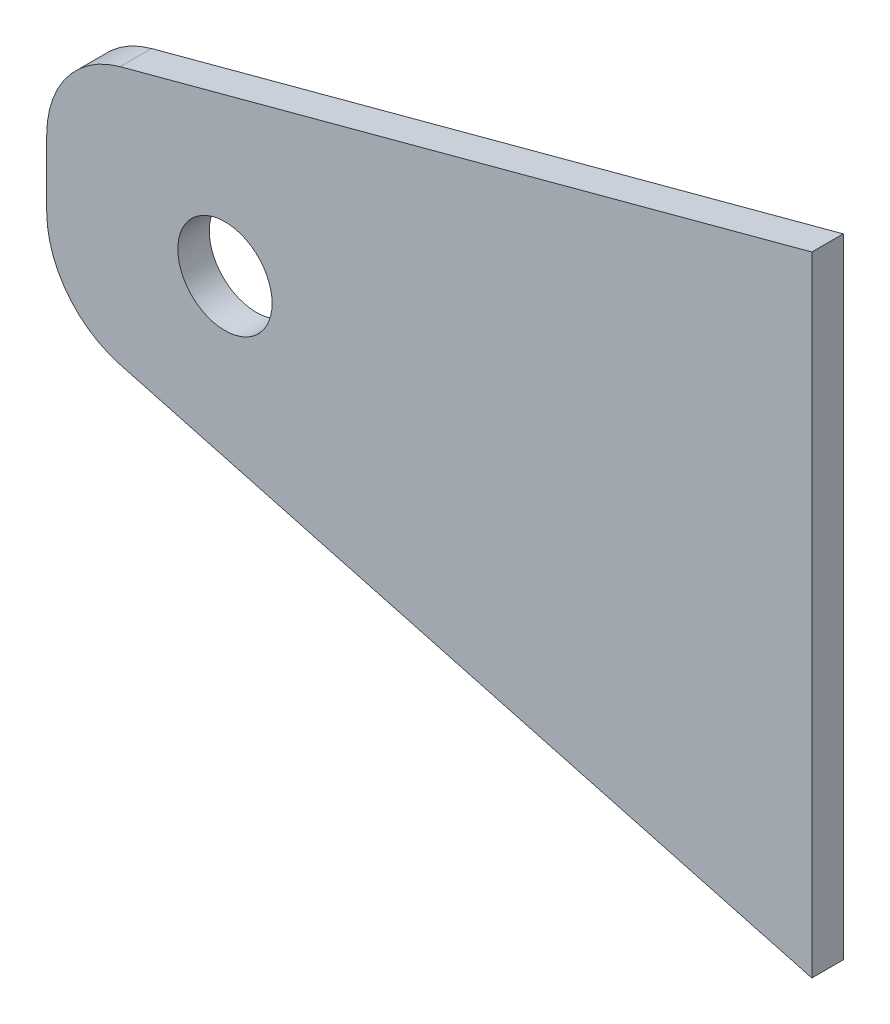
ISO-10303-21;
HEADER;
FILE_DESCRIPTION(('STEP AP214'),'2;1');
FILE_NAME('part.step','',(''),(''),'','','');
FILE_SCHEMA(('AUTOMOTIVE_DESIGN { 1 0 10303 214 1 1 1 1 }'));
ENDSEC;
DATA;
#1=APPLICATION_CONTEXT('core data for automotive mechanical design processes');
#2=APPLICATION_PROTOCOL_DEFINITION('international standard','automotive_design',2000,#1);
#3=PRODUCT_CONTEXT('',#1,'mechanical');
#4=PRODUCT('Part','Part','',(#3));
#5=PRODUCT_RELATED_PRODUCT_CATEGORY('part','',(#4));
#6=PRODUCT_DEFINITION_FORMATION('','',#4);
#7=PRODUCT_DEFINITION_CONTEXT('part definition',#1,'design');
#8=PRODUCT_DEFINITION('design','',#6,#7);
#9=PRODUCT_DEFINITION_SHAPE('','',#8);
#10=(LENGTH_UNIT() NAMED_UNIT(*) SI_UNIT(.MILLI.,.METRE.));
#11=(NAMED_UNIT(*) PLANE_ANGLE_UNIT() SI_UNIT($,.RADIAN.));
#12=(NAMED_UNIT(*) SI_UNIT($,.STERADIAN.) SOLID_ANGLE_UNIT());
#13=UNCERTAINTY_MEASURE_WITH_UNIT(LENGTH_MEASURE(1.E-05),#10,'distance_accuracy_value','');
#14=(GEOMETRIC_REPRESENTATION_CONTEXT(3) GLOBAL_UNCERTAINTY_ASSIGNED_CONTEXT((#13)) GLOBAL_UNIT_ASSIGNED_CONTEXT((#10,
#11,#12)) REPRESENTATION_CONTEXT('',''));
#15=CARTESIAN_POINT('',(0.,0.,0.));
#16=DIRECTION('',(0.,0.,1.));
#17=DIRECTION('',(1.,0.,0.));
#18=AXIS2_PLACEMENT_3D('',#15,#16,#17);
#19=CARTESIAN_POINT('',(0.,0.,3.175));
#20=DIRECTION('',(0.258819045102518,0.965925826289069,0.));
#21=DIRECTION('',(-0.965925826289069,0.258819045102518,0.));
#22=AXIS2_PLACEMENT_3D('',#19,#20,#21);
#23=PLANE('',#22);
#24=DIRECTION('',(0.965925826289069,-0.258819045102518,0.));
#25=VECTOR('',#24,1.);
#26=CARTESIAN_POINT('',(0.,0.,3.175));
#27=LINE('',#26,#25);
#28=CARTESIAN_POINT('',(-69.8622565541506,18.7195352251003,3.175));
#29=VERTEX_POINT('',#28);
#30=CARTESIAN_POINT('',(0.,0.,3.175));
#31=VERTEX_POINT('',#30);
#32=EDGE_CURVE('E91',#29,#31,#27,.T.);
#33=ORIENTED_EDGE('',*,*,#32,.F.);
#34=DIRECTION('',(0.,0.,-1.));
#35=VECTOR('',#34,1.);
#36=CARTESIAN_POINT('',(-69.8622565541506,18.7195352251003,3.175));
#37=LINE('',#36,#35);
#38=CARTESIAN_POINT('',(-69.8622565541506,18.7195352251003,0.));
#39=VERTEX_POINT('',#38);
#40=EDGE_CURVE('E114',#29,#39,#37,.T.);
#41=ORIENTED_EDGE('',*,*,#40,.T.);
#42=DIRECTION('',(0.965925826289069,-0.258819045102518,0.));
#43=VECTOR('',#42,1.);
#44=CARTESIAN_POINT('',(0.,0.,0.));
#45=LINE('',#44,#43);
#46=CARTESIAN_POINT('',(0.,0.,0.));
#47=VERTEX_POINT('',#46);
#48=EDGE_CURVE('E112',#39,#47,#45,.T.);
#49=ORIENTED_EDGE('',*,*,#48,.T.);
#50=DIRECTION('',(0.,0.,-1.));
#51=VECTOR('',#50,1.);
#52=CARTESIAN_POINT('',(0.,0.,3.175));
#53=LINE('',#52,#51);
#54=EDGE_CURVE('E106',#31,#47,#53,.T.);
#55=ORIENTED_EDGE('',*,*,#54,.F.);
#56=EDGE_LOOP('',(#33,#41,#49,#55));
#57=FACE_BOUND('',#56,.T.);
#58=ADVANCED_FACE('F37',(#57),#23,.F.);
#59=CARTESIAN_POINT('',(0.,0.,3.175));
#60=DIRECTION('',(-1.,0.,0.));
#61=DIRECTION('',(0.,0.,1.));
#62=AXIS2_PLACEMENT_3D('',#59,#60,#61);
#63=PLANE('',#62);
#64=DIRECTION('',(0.,1.,0.));
#65=VECTOR('',#64,1.);
#66=CARTESIAN_POINT('',(0.,0.,0.));
#67=LINE('',#66,#65);
#68=CARTESIAN_POINT('',(0.,63.5,0.));
#69=VERTEX_POINT('',#68);
#70=EDGE_CURVE('E141',#47,#69,#67,.T.);
#71=ORIENTED_EDGE('',*,*,#70,.T.);
#72=DIRECTION('',(0.,0.,-1.));
#73=VECTOR('',#72,1.);
#74=CARTESIAN_POINT('',(0.,63.5,3.175));
#75=LINE('',#74,#73);
#76=CARTESIAN_POINT('',(0.,63.5,3.175));
#77=VERTEX_POINT('',#76);
#78=EDGE_CURVE('E108',#77,#69,#75,.T.);
#79=ORIENTED_EDGE('',*,*,#78,.F.);
#80=DIRECTION('',(0.,1.,0.));
#81=VECTOR('',#80,1.);
#82=CARTESIAN_POINT('',(0.,0.,3.175));
#83=LINE('',#82,#81);
#84=EDGE_CURVE('E94',#31,#77,#83,.T.);
#85=ORIENTED_EDGE('',*,*,#84,.F.);
#86=ORIENTED_EDGE('',*,*,#54,.T.);
#87=EDGE_LOOP('',(#71,#79,#85,#86));
#88=FACE_BOUND('',#87,.T.);
#89=ADVANCED_FACE('F105',(#88),#63,.F.);
#90=CARTESIAN_POINT('',(0.,63.5,3.175));
#91=DIRECTION('',(0.258819045102525,-0.965925826289067,0.));
#92=DIRECTION('',(0.965925826289067,0.258819045102525,0.));
#93=AXIS2_PLACEMENT_3D('',#90,#91,#92);
#94=PLANE('',#93);
#95=DIRECTION('',(-0.965925826289067,-0.258819045102525,0.));
#96=VECTOR('',#95,1.);
#97=CARTESIAN_POINT('',(0.,63.5,0.));
#98=LINE('',#97,#96);
#99=CARTESIAN_POINT('',(-69.8622565541506,44.7804647748991,0.));
#100=VERTEX_POINT('',#99);
#101=EDGE_CURVE('E139',#69,#100,#98,.T.);
#102=ORIENTED_EDGE('',*,*,#101,.T.);
#103=DIRECTION('',(0.,0.,-1.));
#104=VECTOR('',#103,1.);
#105=CARTESIAN_POINT('',(-69.8622565541506,44.7804647748991,3.175));
#106=LINE('',#105,#104);
#107=CARTESIAN_POINT('',(-69.8622565541506,44.7804647748991,3.175));
#108=VERTEX_POINT('',#107);
#109=EDGE_CURVE('E11',#100,#108,#106,.F.);
#110=ORIENTED_EDGE('',*,*,#109,.T.);
#111=DIRECTION('',(-0.965925826289067,-0.258819045102525,0.));
#112=VECTOR('',#111,1.);
#113=CARTESIAN_POINT('',(0.,63.5,3.175));
#114=LINE('',#113,#112);
#115=EDGE_CURVE('E109',#77,#108,#114,.T.);
#116=ORIENTED_EDGE('',*,*,#115,.F.);
#117=ORIENTED_EDGE('',*,*,#78,.T.);
#118=EDGE_LOOP('',(#102,#110,#116,#117));
#119=FACE_BOUND('',#118,.T.);
#120=ADVANCED_FACE('F140',(#119),#94,.F.);
#121=CARTESIAN_POINT('',(-77.2740661031254,42.794476391798,3.175));
#122=DIRECTION('',(1.,0.,0.));
#123=DIRECTION('',(0.,0.,-1.));
#124=AXIS2_PLACEMENT_3D('',#121,#122,#123);
#125=PLANE('',#124);
#126=DIRECTION('',(0.,-1.,0.));
#127=VECTOR('',#126,1.);
#128=CARTESIAN_POINT('',(-77.2740661031254,42.794476391798,0.));
#129=LINE('',#128,#127);
#130=CARTESIAN_POINT('',(-77.2740661031254,35.1212065120084,0.));
#131=VERTEX_POINT('',#130);
#132=CARTESIAN_POINT('',(-77.2740661031254,28.378793487991,0.));
#133=VERTEX_POINT('',#132);
#134=EDGE_CURVE('E101',#131,#133,#129,.T.);
#135=ORIENTED_EDGE('',*,*,#134,.T.);
#136=DIRECTION('',(0.,0.,-1.));
#137=VECTOR('',#136,1.);
#138=CARTESIAN_POINT('',(-77.2740661031254,28.378793487991,3.175));
#139=LINE('',#138,#137);
#140=CARTESIAN_POINT('',(-77.2740661031254,28.378793487991,3.175));
#141=VERTEX_POINT('',#140);
#142=EDGE_CURVE('E58',#133,#141,#139,.F.);
#143=ORIENTED_EDGE('',*,*,#142,.T.);
#144=DIRECTION('',(0.,-1.,0.));
#145=VECTOR('',#144,1.);
#146=CARTESIAN_POINT('',(-77.2740661031254,42.794476391798,3.175));
#147=LINE('',#146,#145);
#148=CARTESIAN_POINT('',(-77.2740661031254,35.1212065120084,3.175));
#149=VERTEX_POINT('',#148);
#150=EDGE_CURVE('E118',#149,#141,#147,.T.);
#151=ORIENTED_EDGE('',*,*,#150,.F.);
#152=DIRECTION('',(0.,0.,-1.));
#153=VECTOR('',#152,1.);
#154=CARTESIAN_POINT('',(-77.2740661031254,35.1212065120084,3.175));
#155=LINE('',#154,#153);
#156=EDGE_CURVE('E125',#149,#131,#155,.T.);
#157=ORIENTED_EDGE('',*,*,#156,.T.);
#158=EDGE_LOOP('',(#135,#143,#151,#157));
#159=FACE_BOUND('',#158,.T.);
#160=ADVANCED_FACE('F133',(#159),#125,.F.);
#161=CARTESIAN_POINT('',(0.,0.,3.175));
#162=DIRECTION('',(0.,0.,1.));
#163=DIRECTION('',(1.,0.,0.));
#164=AXIS2_PLACEMENT_3D('',#161,#162,#163);
#165=PLANE('',#164);
#166=CARTESIAN_POINT('',(-59.2740661031254,31.7499999999997,3.175));
#167=DIRECTION('',(0.,0.,1.));
#168=DIRECTION('',(1.,0.,0.));
#169=AXIS2_PLACEMENT_3D('',#166,#167,#168);
#170=CIRCLE('',#169,4.7625);
#171=CARTESIAN_POINT('',(-54.5115661031254,31.7499999999997,3.175));
#172=VERTEX_POINT('',#171);
#173=EDGE_CURVE('E148',#172,#172,#170,.T.);
#174=ORIENTED_EDGE('',*,*,#173,.F.);
#175=EDGE_LOOP('',(#174));
#176=FACE_BOUND('',#175,.T.);
#177=ORIENTED_EDGE('',*,*,#150,.T.);
#178=CARTESIAN_POINT('',(-67.2740661031254,28.378793487991,3.175));
#179=DIRECTION('',(0.,0.,1.));
#180=DIRECTION('',(1.,0.,0.));
#181=AXIS2_PLACEMENT_3D('',#178,#179,#180);
#182=CIRCLE('',#181,10.);
#183=EDGE_CURVE('E45',#141,#29,#182,.T.);
#184=ORIENTED_EDGE('',*,*,#183,.T.);
#185=ORIENTED_EDGE('',*,*,#32,.T.);
#186=ORIENTED_EDGE('',*,*,#84,.T.);
#187=ORIENTED_EDGE('',*,*,#115,.T.);
#188=CARTESIAN_POINT('',(-67.2740661031254,35.1212065120084,3.175));
#189=DIRECTION('',(0.,0.,1.));
#190=DIRECTION('',(1.,0.,0.));
#191=AXIS2_PLACEMENT_3D('',#188,#189,#190);
#192=CIRCLE('',#191,10.);
#193=EDGE_CURVE('E129',#108,#149,#192,.T.);
#194=ORIENTED_EDGE('',*,*,#193,.T.);
#195=EDGE_LOOP('',(#177,#184,#185,#186,#187,#194));
#196=FACE_BOUND('',#195,.T.);
#197=ADVANCED_FACE('F93',(#176,#196),#165,.T.);
#198=CARTESIAN_POINT('',(0.,0.,0.));
#199=DIRECTION('',(0.,0.,1.));
#200=DIRECTION('',(1.,0.,0.));
#201=AXIS2_PLACEMENT_3D('',#198,#199,#200);
#202=PLANE('',#201);
#203=CARTESIAN_POINT('',(-59.2740661031254,31.7499999999997,0.));
#204=DIRECTION('',(0.,0.,1.));
#205=DIRECTION('',(1.,0.,0.));
#206=AXIS2_PLACEMENT_3D('',#203,#204,#205);
#207=CIRCLE('',#206,4.7625);
#208=CARTESIAN_POINT('',(-54.5115661031254,31.7499999999997,0.));
#209=VERTEX_POINT('',#208);
#210=EDGE_CURVE('E145',#209,#209,#207,.T.);
#211=ORIENTED_EDGE('',*,*,#210,.T.);
#212=EDGE_LOOP('',(#211));
#213=FACE_BOUND('',#212,.T.);
#214=ORIENTED_EDGE('',*,*,#48,.F.);
#215=CARTESIAN_POINT('',(-67.2740661031254,28.378793487991,0.));
#216=DIRECTION('',(0.,0.,1.));
#217=DIRECTION('',(1.,0.,0.));
#218=AXIS2_PLACEMENT_3D('',#215,#216,#217);
#219=CIRCLE('',#218,10.);
#220=EDGE_CURVE('E123',#39,#133,#219,.F.);
#221=ORIENTED_EDGE('',*,*,#220,.T.);
#222=ORIENTED_EDGE('',*,*,#134,.F.);
#223=CARTESIAN_POINT('',(-67.2740661031254,35.1212065120084,0.));
#224=DIRECTION('',(0.,0.,1.));
#225=DIRECTION('',(1.,0.,0.));
#226=AXIS2_PLACEMENT_3D('',#223,#224,#225);
#227=CIRCLE('',#226,10.);
#228=EDGE_CURVE('E116',#131,#100,#227,.F.);
#229=ORIENTED_EDGE('',*,*,#228,.T.);
#230=ORIENTED_EDGE('',*,*,#101,.F.);
#231=ORIENTED_EDGE('',*,*,#70,.F.);
#232=EDGE_LOOP('',(#214,#221,#222,#229,#230,#231));
#233=FACE_BOUND('',#232,.T.);
#234=ADVANCED_FACE('F138',(#213,#233),#202,.F.);
#235=CARTESIAN_POINT('',(-59.2740661031254,31.7499999999997,0.));
#236=DIRECTION('',(0.,0.,1.));
#237=DIRECTION('',(1.,0.,0.));
#238=AXIS2_PLACEMENT_3D('',#235,#236,#237);
#239=CYLINDRICAL_SURFACE('',#238,4.7625);
#240=ORIENTED_EDGE('',*,*,#210,.F.);
#241=EDGE_LOOP('',(#240));
#242=FACE_BOUND('',#241,.T.);
#243=ORIENTED_EDGE('',*,*,#173,.T.);
#244=EDGE_LOOP('',(#243));
#245=FACE_BOUND('',#244,.T.);
#246=ADVANCED_FACE('F155',(#242,#245),#239,.F.);
#247=CARTESIAN_POINT('',(-67.2740661031254,28.378793487991,3.175));
#248=DIRECTION('',(0.,0.,-1.));
#249=DIRECTION('',(-1.,0.,0.));
#250=AXIS2_PLACEMENT_3D('',#247,#248,#249);
#251=CYLINDRICAL_SURFACE('',#250,10.);
#252=ORIENTED_EDGE('',*,*,#183,.F.);
#253=ORIENTED_EDGE('',*,*,#142,.F.);
#254=ORIENTED_EDGE('',*,*,#220,.F.);
#255=ORIENTED_EDGE('',*,*,#40,.F.);
#256=EDGE_LOOP('',(#252,#253,#254,#255));
#257=FACE_BOUND('',#256,.T.);
#258=ADVANCED_FACE('F158',(#257),#251,.T.);
#259=CARTESIAN_POINT('',(-67.2740661031254,35.1212065120084,3.175));
#260=DIRECTION('',(0.,0.,-1.));
#261=DIRECTION('',(-1.,0.,0.));
#262=AXIS2_PLACEMENT_3D('',#259,#260,#261);
#263=CYLINDRICAL_SURFACE('',#262,10.);
#264=ORIENTED_EDGE('',*,*,#193,.F.);
#265=ORIENTED_EDGE('',*,*,#109,.F.);
#266=ORIENTED_EDGE('',*,*,#228,.F.);
#267=ORIENTED_EDGE('',*,*,#156,.F.);
#268=EDGE_LOOP('',(#264,#265,#266,#267));
#269=FACE_BOUND('',#268,.T.);
#270=ADVANCED_FACE('F39',(#269),#263,.T.);
#271=CLOSED_SHELL('',(#58,#89,#120,#160,#197,#234,#246,#258,#270));
#272=MANIFOLD_SOLID_BREP('B2',#271);
#273=ADVANCED_BREP_SHAPE_REPRESENTATION('',(#18,#272),#14);
#274=SHAPE_DEFINITION_REPRESENTATION(#9,#273);
ENDSEC;
END-ISO-10303-21;
